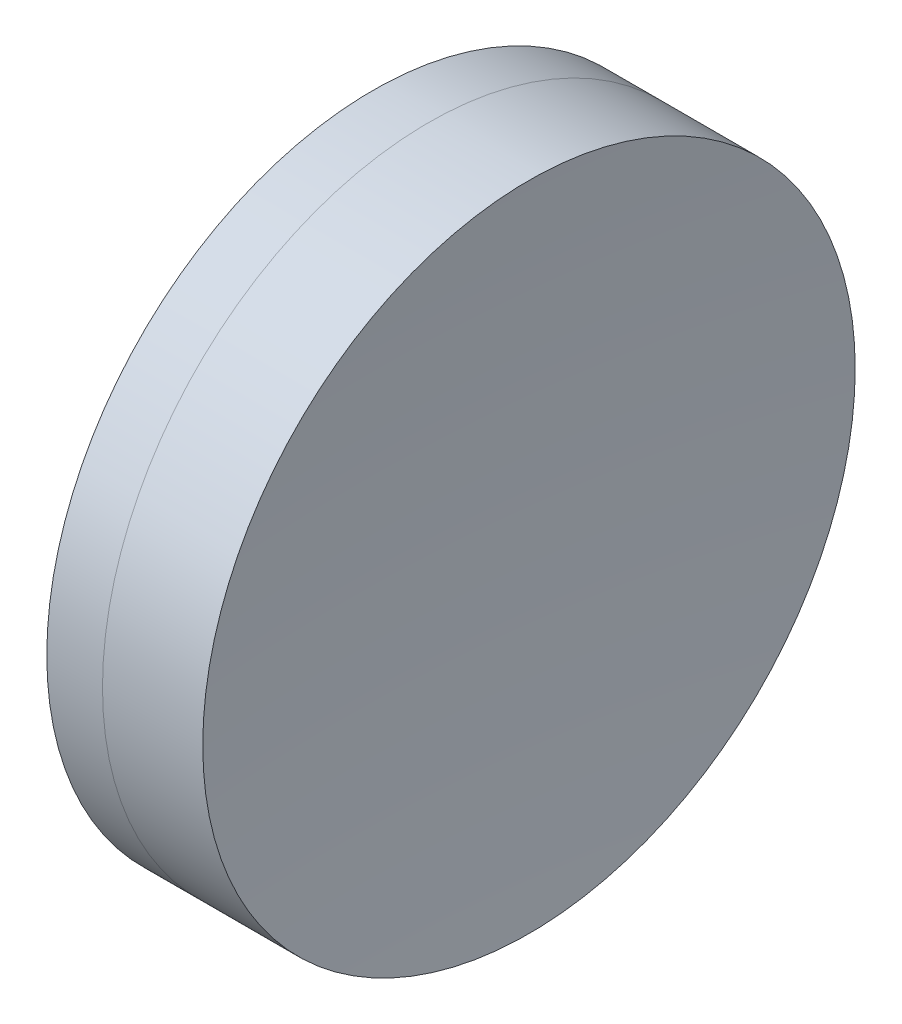
ISO-10303-21;
HEADER;
FILE_DESCRIPTION(('STEP AP214'),'2;1');
FILE_NAME('part.step','',(''),(''),'','','');
FILE_SCHEMA(('AUTOMOTIVE_DESIGN { 1 0 10303 214 1 1 1 1 }'));
ENDSEC;
DATA;
#1=APPLICATION_CONTEXT('core data for automotive mechanical design processes');
#2=APPLICATION_PROTOCOL_DEFINITION('international standard','automotive_design',2000,#1);
#3=PRODUCT_CONTEXT('',#1,'mechanical');
#4=PRODUCT('Part','Part','',(#3));
#5=PRODUCT_RELATED_PRODUCT_CATEGORY('part','',(#4));
#6=PRODUCT_DEFINITION_FORMATION('','',#4);
#7=PRODUCT_DEFINITION_CONTEXT('part definition',#1,'design');
#8=PRODUCT_DEFINITION('design','',#6,#7);
#9=PRODUCT_DEFINITION_SHAPE('','',#8);
#10=(LENGTH_UNIT() NAMED_UNIT(*) SI_UNIT(.MILLI.,.METRE.));
#11=(NAMED_UNIT(*) PLANE_ANGLE_UNIT() SI_UNIT($,.RADIAN.));
#12=(NAMED_UNIT(*) SI_UNIT($,.STERADIAN.) SOLID_ANGLE_UNIT());
#13=UNCERTAINTY_MEASURE_WITH_UNIT(LENGTH_MEASURE(1.E-05),#10,'distance_accuracy_value','');
#14=(GEOMETRIC_REPRESENTATION_CONTEXT(3) GLOBAL_UNCERTAINTY_ASSIGNED_CONTEXT((#13)) GLOBAL_UNIT_ASSIGNED_CONTEXT((#10,
#11,#12)) REPRESENTATION_CONTEXT('',''));
#15=CARTESIAN_POINT('',(0.,0.,0.));
#16=DIRECTION('',(0.,0.,1.));
#17=DIRECTION('',(1.,0.,0.));
#18=AXIS2_PLACEMENT_3D('',#15,#16,#17);
#19=CARTESIAN_POINT('',(-4.66825751421033,0.,0.));
#20=DIRECTION('',(-1.,0.,0.));
#21=DIRECTION('',(0.,0.,1.));
#22=AXIS2_PLACEMENT_3D('',#19,#20,#21);
#23=SPHERICAL_SURFACE('',#22,93.11);
#24=CARTESIAN_POINT('',(87.5715500528049,0.,0.));
#25=DIRECTION('',(-1.,0.,0.));
#26=DIRECTION('',(0.,0.,1.));
#27=AXIS2_PLACEMENT_3D('',#24,#25,#26);
#28=CIRCLE('',#27,12.7000000000001);
#29=CARTESIAN_POINT('',(87.5715500528049,0.,12.7000000000001));
#30=VERTEX_POINT('',#29);
#31=EDGE_CURVE('E51',#30,#30,#28,.T.);
#32=ORIENTED_EDGE('',*,*,#31,.T.);
#33=EDGE_LOOP('',(#32));
#34=FACE_BOUND('',#33,.T.);
#35=ADVANCED_FACE('F45',(#34),#23,.F.);
#36=CARTESIAN_POINT('',(242.30174248579,0.,0.));
#37=DIRECTION('',(-1.,0.,0.));
#38=DIRECTION('',(0.,0.,-1.));
#39=AXIS2_PLACEMENT_3D('',#36,#37,#38);
#40=SPHERICAL_SURFACE('',#39,151.36);
#41=CARTESIAN_POINT('',(91.4754861508929,0.,0.));
#42=DIRECTION('',(-1.,0.,0.));
#43=DIRECTION('',(0.,0.,1.));
#44=AXIS2_PLACEMENT_3D('',#41,#42,#43);
#45=CIRCLE('',#44,12.7000000000001);
#46=CARTESIAN_POINT('',(91.4754861508929,0.,12.7000000000001));
#47=VERTEX_POINT('',#46);
#48=EDGE_CURVE('E11',#47,#47,#45,.T.);
#49=ORIENTED_EDGE('',*,*,#48,.F.);
#50=EDGE_LOOP('',(#49));
#51=FACE_BOUND('',#50,.T.);
#52=ADVANCED_FACE('F60',(#51),#40,.F.);
#53=CARTESIAN_POINT('',(-0.551919992657797,0.,0.));
#54=DIRECTION('',(-1.,0.,0.));
#55=DIRECTION('',(0.,0.,1.));
#56=AXIS2_PLACEMENT_3D('',#53,#54,#55);
#57=CYLINDRICAL_SURFACE('',#56,12.7000000000001);
#58=ORIENTED_EDGE('',*,*,#48,.T.);
#59=EDGE_LOOP('',(#58));
#60=FACE_BOUND('',#59,.T.);
#61=ORIENTED_EDGE('',*,*,#31,.F.);
#62=EDGE_LOOP('',(#61));
#63=FACE_BOUND('',#62,.T.);
#64=ADVANCED_FACE('F58',(#60,#63),#57,.T.);
#65=CLOSED_SHELL('',(#35,#52,#64));
#66=MANIFOLD_SOLID_BREP('B2',#65);
#67=CARTESIAN_POINT('',(154.24174248579,0.,0.));
#68=DIRECTION('',(-1.,0.,0.));
#69=DIRECTION('',(0.,0.,-1.));
#70=AXIS2_PLACEMENT_3D('',#67,#68,#69);
#71=SPHERICAL_SURFACE('',#70,70.);
#72=CARTESIAN_POINT('',(85.403453721469,0.,0.));
#73=DIRECTION('',(-1.,0.,0.));
#74=DIRECTION('',(0.,0.,1.));
#75=AXIS2_PLACEMENT_3D('',#72,#73,#74);
#76=CIRCLE('',#75,12.7);
#77=CARTESIAN_POINT('',(85.403453721469,0.,12.7));
#78=VERTEX_POINT('',#77);
#79=EDGE_CURVE('E44',#78,#78,#76,.T.);
#80=ORIENTED_EDGE('',*,*,#79,.T.);
#81=EDGE_LOOP('',(#80));
#82=FACE_BOUND('',#81,.T.);
#83=ADVANCED_FACE('F86',(#82),#71,.T.);
#84=CARTESIAN_POINT('',(-0.816062176165804,0.,0.));
#85=DIRECTION('',(-1.,0.,0.));
#86=DIRECTION('',(0.,0.,1.));
#87=AXIS2_PLACEMENT_3D('',#84,#85,#86);
#88=CYLINDRICAL_SURFACE('',#87,12.7);
#89=CARTESIAN_POINT('',(87.5715500528049,0.,0.));
#90=DIRECTION('',(-1.,0.,0.));
#91=DIRECTION('',(0.,0.,1.));
#92=AXIS2_PLACEMENT_3D('',#89,#90,#91);
#93=CIRCLE('',#92,12.7);
#94=CARTESIAN_POINT('',(87.5715500528049,0.,12.7));
#95=VERTEX_POINT('',#94);
#96=EDGE_CURVE('E92',#95,#95,#93,.T.);
#97=ORIENTED_EDGE('',*,*,#96,.T.);
#98=EDGE_LOOP('',(#97));
#99=FACE_BOUND('',#98,.T.);
#100=ORIENTED_EDGE('',*,*,#79,.F.);
#101=EDGE_LOOP('',(#100));
#102=FACE_BOUND('',#101,.T.);
#103=ADVANCED_FACE('F98',(#99,#102),#88,.T.);
#104=CARTESIAN_POINT('',(-4.66825751421033,0.,0.));
#105=DIRECTION('',(-1.,0.,0.));
#106=DIRECTION('',(0.,0.,1.));
#107=AXIS2_PLACEMENT_3D('',#104,#105,#106);
#108=SPHERICAL_SURFACE('',#107,93.11);
#109=ORIENTED_EDGE('',*,*,#96,.F.);
#110=EDGE_LOOP('',(#109));
#111=FACE_BOUND('',#110,.T.);
#112=ADVANCED_FACE('F101',(#111),#108,.T.);
#113=CLOSED_SHELL('',(#83,#103,#112));
#114=MANIFOLD_SOLID_BREP('B6',#113);
#115=ADVANCED_BREP_SHAPE_REPRESENTATION('',(#18,#66,#114),#14);
#116=SHAPE_DEFINITION_REPRESENTATION(#9,#115);
ENDSEC;
END-ISO-10303-21;
